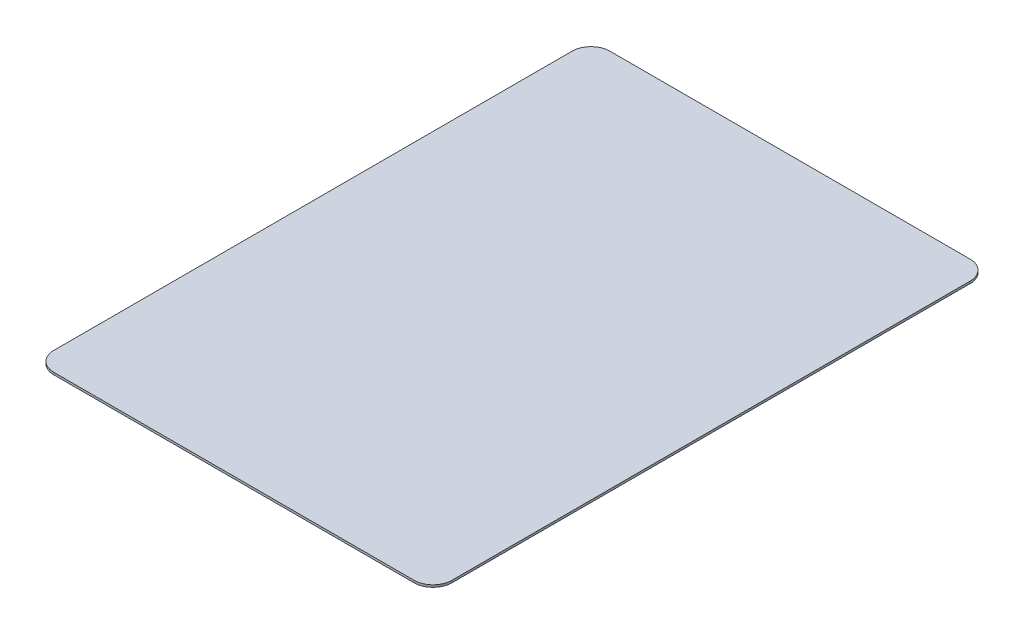
ISO-10303-21;
HEADER;
FILE_DESCRIPTION(('STEP AP214'),'2;1');
FILE_NAME('part.step','',(''),(''),'','','');
FILE_SCHEMA(('AUTOMOTIVE_DESIGN { 1 0 10303 214 1 1 1 1 }'));
ENDSEC;
DATA;
#1=APPLICATION_CONTEXT('core data for automotive mechanical design processes');
#2=APPLICATION_PROTOCOL_DEFINITION('international standard','automotive_design',2000,#1);
#3=PRODUCT_CONTEXT('',#1,'mechanical');
#4=PRODUCT('Part','Part','',(#3));
#5=PRODUCT_RELATED_PRODUCT_CATEGORY('part','',(#4));
#6=PRODUCT_DEFINITION_FORMATION('','',#4);
#7=PRODUCT_DEFINITION_CONTEXT('part definition',#1,'design');
#8=PRODUCT_DEFINITION('design','',#6,#7);
#9=PRODUCT_DEFINITION_SHAPE('','',#8);
#10=(LENGTH_UNIT() NAMED_UNIT(*) SI_UNIT(.MILLI.,.METRE.));
#11=(NAMED_UNIT(*) PLANE_ANGLE_UNIT() SI_UNIT($,.RADIAN.));
#12=(NAMED_UNIT(*) SI_UNIT($,.STERADIAN.) SOLID_ANGLE_UNIT());
#13=UNCERTAINTY_MEASURE_WITH_UNIT(LENGTH_MEASURE(1.E-05),#10,'distance_accuracy_value','');
#14=(GEOMETRIC_REPRESENTATION_CONTEXT(3) GLOBAL_UNCERTAINTY_ASSIGNED_CONTEXT((#13)) GLOBAL_UNIT_ASSIGNED_CONTEXT((#10,
#11,#12)) REPRESENTATION_CONTEXT('',''));
#15=CARTESIAN_POINT('',(0.,0.,0.));
#16=DIRECTION('',(0.,0.,1.));
#17=DIRECTION('',(1.,0.,0.));
#18=AXIS2_PLACEMENT_3D('',#15,#16,#17);
#19=CARTESIAN_POINT('',(-28.5,0.35,41.));
#20=DIRECTION('',(0.,-1.,0.));
#21=DIRECTION('',(0.,0.,-1.));
#22=AXIS2_PLACEMENT_3D('',#19,#20,#21);
#23=CYLINDRICAL_SURFACE('',#22,3.);
#24=CARTESIAN_POINT('',(-28.5,0.,41.));
#25=DIRECTION('',(0.,1.,0.));
#26=DIRECTION('',(0.,0.,-1.));
#27=AXIS2_PLACEMENT_3D('',#24,#25,#26);
#28=CIRCLE('',#27,3.);
#29=CARTESIAN_POINT('',(-31.5,0.,41.));
#30=VERTEX_POINT('',#29);
#31=CARTESIAN_POINT('',(-28.5,0.,44.));
#32=VERTEX_POINT('',#31);
#33=EDGE_CURVE('E128',#30,#32,#28,.T.);
#34=ORIENTED_EDGE('',*,*,#33,.T.);
#35=DIRECTION('',(0.,-1.,0.));
#36=VECTOR('',#35,1.);
#37=CARTESIAN_POINT('',(-28.5,0.35,44.));
#38=LINE('',#37,#36);
#39=CARTESIAN_POINT('',(-28.5,0.35,44.));
#40=VERTEX_POINT('',#39);
#41=EDGE_CURVE('E11',#40,#32,#38,.T.);
#42=ORIENTED_EDGE('',*,*,#41,.F.);
#43=CARTESIAN_POINT('',(-28.5,0.35,41.));
#44=DIRECTION('',(0.,1.,0.));
#45=DIRECTION('',(0.,0.,-1.));
#46=AXIS2_PLACEMENT_3D('',#43,#44,#45);
#47=CIRCLE('',#46,3.);
#48=CARTESIAN_POINT('',(-31.5,0.35,41.));
#49=VERTEX_POINT('',#48);
#50=EDGE_CURVE('E142',#49,#40,#47,.T.);
#51=ORIENTED_EDGE('',*,*,#50,.F.);
#52=DIRECTION('',(0.,-1.,0.));
#53=VECTOR('',#52,1.);
#54=CARTESIAN_POINT('',(-31.5,0.35,41.));
#55=LINE('',#54,#53);
#56=EDGE_CURVE('E124',#49,#30,#55,.T.);
#57=ORIENTED_EDGE('',*,*,#56,.T.);
#58=EDGE_LOOP('',(#34,#42,#51,#57));
#59=FACE_BOUND('',#58,.T.);
#60=ADVANCED_FACE('F32',(#59),#23,.T.);
#61=CARTESIAN_POINT('',(28.5,0.35,44.));
#62=DIRECTION('',(0.,0.,-1.));
#63=DIRECTION('',(-1.,0.,0.));
#64=AXIS2_PLACEMENT_3D('',#61,#62,#63);
#65=PLANE('',#64);
#66=DIRECTION('',(1.,0.,0.));
#67=VECTOR('',#66,1.);
#68=CARTESIAN_POINT('',(28.5,0.,44.));
#69=LINE('',#68,#67);
#70=CARTESIAN_POINT('',(28.5,0.,44.));
#71=VERTEX_POINT('',#70);
#72=EDGE_CURVE('E131',#32,#71,#69,.T.);
#73=ORIENTED_EDGE('',*,*,#72,.T.);
#74=DIRECTION('',(0.,-1.,0.));
#75=VECTOR('',#74,1.);
#76=CARTESIAN_POINT('',(28.5,0.35,44.));
#77=LINE('',#76,#75);
#78=CARTESIAN_POINT('',(28.5,0.35,44.));
#79=VERTEX_POINT('',#78);
#80=EDGE_CURVE('E40',#79,#71,#77,.T.);
#81=ORIENTED_EDGE('',*,*,#80,.F.);
#82=DIRECTION('',(1.,0.,0.));
#83=VECTOR('',#82,1.);
#84=CARTESIAN_POINT('',(28.5,0.35,44.));
#85=LINE('',#84,#83);
#86=EDGE_CURVE('E91',#40,#79,#85,.T.);
#87=ORIENTED_EDGE('',*,*,#86,.F.);
#88=ORIENTED_EDGE('',*,*,#41,.T.);
#89=EDGE_LOOP('',(#73,#81,#87,#88));
#90=FACE_BOUND('',#89,.T.);
#91=ADVANCED_FACE('F177',(#90),#65,.F.);
#92=CARTESIAN_POINT('',(28.5,0.35,41.));
#93=DIRECTION('',(0.,-1.,0.));
#94=DIRECTION('',(0.,0.,-1.));
#95=AXIS2_PLACEMENT_3D('',#92,#93,#94);
#96=CYLINDRICAL_SURFACE('',#95,3.);
#97=CARTESIAN_POINT('',(28.5,0.,41.));
#98=DIRECTION('',(0.,1.,0.));
#99=DIRECTION('',(0.,0.,1.));
#100=AXIS2_PLACEMENT_3D('',#97,#98,#99);
#101=CIRCLE('',#100,3.);
#102=CARTESIAN_POINT('',(31.5,0.,41.));
#103=VERTEX_POINT('',#102);
#104=EDGE_CURVE('E133',#71,#103,#101,.T.);
#105=ORIENTED_EDGE('',*,*,#104,.T.);
#106=DIRECTION('',(0.,-1.,0.));
#107=VECTOR('',#106,1.);
#108=CARTESIAN_POINT('',(31.5,0.35,41.));
#109=LINE('',#108,#107);
#110=CARTESIAN_POINT('',(31.5,0.35,41.));
#111=VERTEX_POINT('',#110);
#112=EDGE_CURVE('E149',#111,#103,#109,.T.);
#113=ORIENTED_EDGE('',*,*,#112,.F.);
#114=CARTESIAN_POINT('',(28.5,0.35,41.));
#115=DIRECTION('',(0.,1.,0.));
#116=DIRECTION('',(0.,0.,1.));
#117=AXIS2_PLACEMENT_3D('',#114,#115,#116);
#118=CIRCLE('',#117,3.);
#119=EDGE_CURVE('E157',#79,#111,#118,.T.);
#120=ORIENTED_EDGE('',*,*,#119,.F.);
#121=ORIENTED_EDGE('',*,*,#80,.T.);
#122=EDGE_LOOP('',(#105,#113,#120,#121));
#123=FACE_BOUND('',#122,.T.);
#124=ADVANCED_FACE('F155',(#123),#96,.T.);
#125=CARTESIAN_POINT('',(31.5,0.35,41.));
#126=DIRECTION('',(-1.,0.,0.));
#127=DIRECTION('',(0.,0.,1.));
#128=AXIS2_PLACEMENT_3D('',#125,#126,#127);
#129=PLANE('',#128);
#130=DIRECTION('',(0.,0.,-1.));
#131=VECTOR('',#130,1.);
#132=CARTESIAN_POINT('',(31.5,0.,41.));
#133=LINE('',#132,#131);
#134=CARTESIAN_POINT('',(31.5,0.,-41.));
#135=VERTEX_POINT('',#134);
#136=EDGE_CURVE('E135',#103,#135,#133,.T.);
#137=ORIENTED_EDGE('',*,*,#136,.T.);
#138=DIRECTION('',(0.,-1.,0.));
#139=VECTOR('',#138,1.);
#140=CARTESIAN_POINT('',(31.5,0.35,-41.));
#141=LINE('',#140,#139);
#142=CARTESIAN_POINT('',(31.5,0.35,-41.));
#143=VERTEX_POINT('',#142);
#144=EDGE_CURVE('E146',#143,#135,#141,.T.);
#145=ORIENTED_EDGE('',*,*,#144,.F.);
#146=DIRECTION('',(0.,0.,-1.));
#147=VECTOR('',#146,1.);
#148=CARTESIAN_POINT('',(31.5,0.35,41.));
#149=LINE('',#148,#147);
#150=EDGE_CURVE('E169',#111,#143,#149,.T.);
#151=ORIENTED_EDGE('',*,*,#150,.F.);
#152=ORIENTED_EDGE('',*,*,#112,.T.);
#153=EDGE_LOOP('',(#137,#145,#151,#152));
#154=FACE_BOUND('',#153,.T.);
#155=ADVANCED_FACE('F165',(#154),#129,.F.);
#156=CARTESIAN_POINT('',(28.5,0.35,-41.));
#157=DIRECTION('',(0.,-1.,0.));
#158=DIRECTION('',(0.,0.,-1.));
#159=AXIS2_PLACEMENT_3D('',#156,#157,#158);
#160=CYLINDRICAL_SURFACE('',#159,3.);
#161=CARTESIAN_POINT('',(28.5,0.,-41.));
#162=DIRECTION('',(0.,1.,0.));
#163=DIRECTION('',(0.,0.,1.));
#164=AXIS2_PLACEMENT_3D('',#161,#162,#163);
#165=CIRCLE('',#164,3.);
#166=CARTESIAN_POINT('',(28.5,0.,-44.));
#167=VERTEX_POINT('',#166);
#168=EDGE_CURVE('E137',#135,#167,#165,.T.);
#169=ORIENTED_EDGE('',*,*,#168,.T.);
#170=DIRECTION('',(0.,-1.,0.));
#171=VECTOR('',#170,1.);
#172=CARTESIAN_POINT('',(28.5,0.35,-44.));
#173=LINE('',#172,#171);
#174=CARTESIAN_POINT('',(28.5,0.35,-44.));
#175=VERTEX_POINT('',#174);
#176=EDGE_CURVE('E119',#175,#167,#173,.T.);
#177=ORIENTED_EDGE('',*,*,#176,.F.);
#178=CARTESIAN_POINT('',(28.5,0.35,-41.));
#179=DIRECTION('',(0.,1.,0.));
#180=DIRECTION('',(0.,0.,1.));
#181=AXIS2_PLACEMENT_3D('',#178,#179,#180);
#182=CIRCLE('',#181,3.);
#183=EDGE_CURVE('E110',#143,#175,#182,.T.);
#184=ORIENTED_EDGE('',*,*,#183,.F.);
#185=ORIENTED_EDGE('',*,*,#144,.T.);
#186=EDGE_LOOP('',(#169,#177,#184,#185));
#187=FACE_BOUND('',#186,.T.);
#188=ADVANCED_FACE('F168',(#187),#160,.T.);
#189=CARTESIAN_POINT('',(28.5,0.35,-44.));
#190=DIRECTION('',(0.,0.,1.));
#191=DIRECTION('',(1.,0.,0.));
#192=AXIS2_PLACEMENT_3D('',#189,#190,#191);
#193=PLANE('',#192);
#194=DIRECTION('',(-1.,0.,0.));
#195=VECTOR('',#194,1.);
#196=CARTESIAN_POINT('',(28.5,0.,-44.));
#197=LINE('',#196,#195);
#198=CARTESIAN_POINT('',(-28.5,0.,-44.));
#199=VERTEX_POINT('',#198);
#200=EDGE_CURVE('E118',#167,#199,#197,.T.);
#201=ORIENTED_EDGE('',*,*,#200,.T.);
#202=DIRECTION('',(0.,-1.,0.));
#203=VECTOR('',#202,1.);
#204=CARTESIAN_POINT('',(-28.5,0.35,-44.));
#205=LINE('',#204,#203);
#206=CARTESIAN_POINT('',(-28.5,0.35,-44.));
#207=VERTEX_POINT('',#206);
#208=EDGE_CURVE('E115',#207,#199,#205,.T.);
#209=ORIENTED_EDGE('',*,*,#208,.F.);
#210=DIRECTION('',(-1.,0.,0.));
#211=VECTOR('',#210,1.);
#212=CARTESIAN_POINT('',(28.5,0.35,-44.));
#213=LINE('',#212,#211);
#214=EDGE_CURVE('E104',#175,#207,#213,.T.);
#215=ORIENTED_EDGE('',*,*,#214,.F.);
#216=ORIENTED_EDGE('',*,*,#176,.T.);
#217=EDGE_LOOP('',(#201,#209,#215,#216));
#218=FACE_BOUND('',#217,.T.);
#219=ADVANCED_FACE('F116',(#218),#193,.F.);
#220=CARTESIAN_POINT('',(-28.5,0.35,-41.));
#221=DIRECTION('',(0.,-1.,0.));
#222=DIRECTION('',(0.,0.,-1.));
#223=AXIS2_PLACEMENT_3D('',#220,#221,#222);
#224=CYLINDRICAL_SURFACE('',#223,3.);
#225=CARTESIAN_POINT('',(-28.5,0.,-41.));
#226=DIRECTION('',(0.,1.,0.));
#227=DIRECTION('',(0.,0.,1.));
#228=AXIS2_PLACEMENT_3D('',#225,#226,#227);
#229=CIRCLE('',#228,3.);
#230=CARTESIAN_POINT('',(-31.5,0.,-41.));
#231=VERTEX_POINT('',#230);
#232=EDGE_CURVE('E77',#199,#231,#229,.T.);
#233=ORIENTED_EDGE('',*,*,#232,.T.);
#234=DIRECTION('',(0.,-1.,0.));
#235=VECTOR('',#234,1.);
#236=CARTESIAN_POINT('',(-31.5,0.35,-41.));
#237=LINE('',#236,#235);
#238=CARTESIAN_POINT('',(-31.5,0.35,-41.));
#239=VERTEX_POINT('',#238);
#240=EDGE_CURVE('E120',#239,#231,#237,.T.);
#241=ORIENTED_EDGE('',*,*,#240,.F.);
#242=CARTESIAN_POINT('',(-28.5,0.35,-41.));
#243=DIRECTION('',(0.,1.,0.));
#244=DIRECTION('',(0.,0.,1.));
#245=AXIS2_PLACEMENT_3D('',#242,#243,#244);
#246=CIRCLE('',#245,3.);
#247=EDGE_CURVE('E108',#207,#239,#246,.T.);
#248=ORIENTED_EDGE('',*,*,#247,.F.);
#249=ORIENTED_EDGE('',*,*,#208,.T.);
#250=EDGE_LOOP('',(#233,#241,#248,#249));
#251=FACE_BOUND('',#250,.T.);
#252=ADVANCED_FACE('F122',(#251),#224,.T.);
#253=CARTESIAN_POINT('',(-31.5,0.35,41.));
#254=DIRECTION('',(1.,0.,0.));
#255=DIRECTION('',(0.,0.,-1.));
#256=AXIS2_PLACEMENT_3D('',#253,#254,#255);
#257=PLANE('',#256);
#258=DIRECTION('',(0.,0.,1.));
#259=VECTOR('',#258,1.);
#260=CARTESIAN_POINT('',(-31.5,0.,41.));
#261=LINE('',#260,#259);
#262=EDGE_CURVE('E83',#231,#30,#261,.T.);
#263=ORIENTED_EDGE('',*,*,#262,.T.);
#264=ORIENTED_EDGE('',*,*,#56,.F.);
#265=DIRECTION('',(0.,0.,1.));
#266=VECTOR('',#265,1.);
#267=CARTESIAN_POINT('',(-31.5,0.35,41.));
#268=LINE('',#267,#266);
#269=EDGE_CURVE('E48',#239,#49,#268,.T.);
#270=ORIENTED_EDGE('',*,*,#269,.F.);
#271=ORIENTED_EDGE('',*,*,#240,.T.);
#272=EDGE_LOOP('',(#263,#264,#270,#271));
#273=FACE_BOUND('',#272,.T.);
#274=ADVANCED_FACE('F193',(#273),#257,.F.);
#275=CARTESIAN_POINT('',(-28.5,0.35,41.));
#276=DIRECTION('',(0.,-1.,0.));
#277=DIRECTION('',(0.,0.,-1.));
#278=AXIS2_PLACEMENT_3D('',#275,#276,#277);
#279=PLANE('',#278);
#280=ORIENTED_EDGE('',*,*,#50,.T.);
#281=ORIENTED_EDGE('',*,*,#86,.T.);
#282=ORIENTED_EDGE('',*,*,#119,.T.);
#283=ORIENTED_EDGE('',*,*,#150,.T.);
#284=ORIENTED_EDGE('',*,*,#183,.T.);
#285=ORIENTED_EDGE('',*,*,#214,.T.);
#286=ORIENTED_EDGE('',*,*,#247,.T.);
#287=ORIENTED_EDGE('',*,*,#269,.T.);
#288=EDGE_LOOP('',(#280,#281,#282,#283,#284,#285,#286,#287));
#289=FACE_BOUND('',#288,.T.);
#290=ADVANCED_FACE('F106',(#289),#279,.F.);
#291=CARTESIAN_POINT('',(-28.5,0.,41.));
#292=DIRECTION('',(0.,-1.,0.));
#293=DIRECTION('',(0.,0.,-1.));
#294=AXIS2_PLACEMENT_3D('',#291,#292,#293);
#295=PLANE('',#294);
#296=ORIENTED_EDGE('',*,*,#33,.F.);
#297=ORIENTED_EDGE('',*,*,#262,.F.);
#298=ORIENTED_EDGE('',*,*,#232,.F.);
#299=ORIENTED_EDGE('',*,*,#200,.F.);
#300=ORIENTED_EDGE('',*,*,#168,.F.);
#301=ORIENTED_EDGE('',*,*,#136,.F.);
#302=ORIENTED_EDGE('',*,*,#104,.F.);
#303=ORIENTED_EDGE('',*,*,#72,.F.);
#304=EDGE_LOOP('',(#296,#297,#298,#299,#300,#301,#302,#303));
#305=FACE_BOUND('',#304,.T.);
#306=ADVANCED_FACE('F161',(#305),#295,.T.);
#307=CLOSED_SHELL('',(#60,#91,#124,#155,#188,#219,#252,#274,#290,#306));
#308=MANIFOLD_SOLID_BREP('B2',#307);
#309=ADVANCED_BREP_SHAPE_REPRESENTATION('',(#18,#308),#14);
#310=SHAPE_DEFINITION_REPRESENTATION(#9,#309);
ENDSEC;
END-ISO-10303-21;
